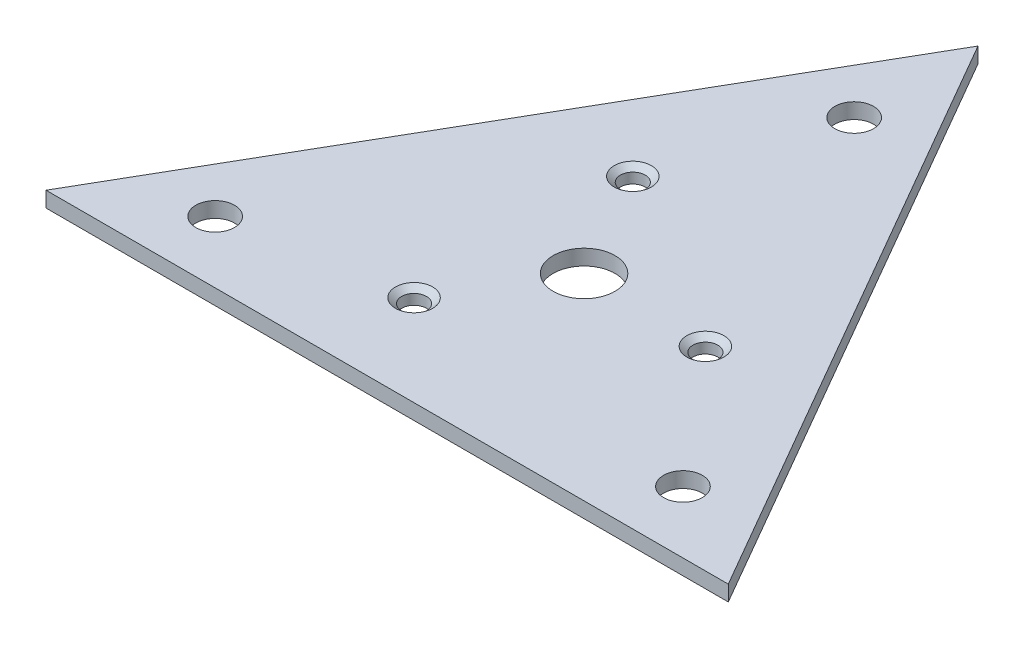
ISO-10303-21;
HEADER;
FILE_DESCRIPTION(('STEP AP214'),'2;1');
FILE_NAME('part.step','',(''),(''),'','','');
FILE_SCHEMA(('AUTOMOTIVE_DESIGN { 1 0 10303 214 1 1 1 1 }'));
ENDSEC;
DATA;
#1=APPLICATION_CONTEXT('core data for automotive mechanical design processes');
#2=APPLICATION_PROTOCOL_DEFINITION('international standard','automotive_design',2000,#1);
#3=PRODUCT_CONTEXT('',#1,'mechanical');
#4=PRODUCT('Part','Part','',(#3));
#5=PRODUCT_RELATED_PRODUCT_CATEGORY('part','',(#4));
#6=PRODUCT_DEFINITION_FORMATION('','',#4);
#7=PRODUCT_DEFINITION_CONTEXT('part definition',#1,'design');
#8=PRODUCT_DEFINITION('design','',#6,#7);
#9=PRODUCT_DEFINITION_SHAPE('','',#8);
#10=(LENGTH_UNIT() NAMED_UNIT(*) SI_UNIT(.MILLI.,.METRE.));
#11=(NAMED_UNIT(*) PLANE_ANGLE_UNIT() SI_UNIT($,.RADIAN.));
#12=(NAMED_UNIT(*) SI_UNIT($,.STERADIAN.) SOLID_ANGLE_UNIT());
#13=UNCERTAINTY_MEASURE_WITH_UNIT(LENGTH_MEASURE(1.E-05),#10,'distance_accuracy_value','');
#14=(GEOMETRIC_REPRESENTATION_CONTEXT(3) GLOBAL_UNCERTAINTY_ASSIGNED_CONTEXT((#13)) GLOBAL_UNIT_ASSIGNED_CONTEXT((#10,
#11,#12)) REPRESENTATION_CONTEXT('',''));
#15=CARTESIAN_POINT('',(0.,0.,0.));
#16=DIRECTION('',(0.,0.,1.));
#17=DIRECTION('',(1.,0.,0.));
#18=AXIS2_PLACEMENT_3D('',#15,#16,#17);
#19=CARTESIAN_POINT('',(0.,3.175,0.));
#20=DIRECTION('',(0.,1.,0.));
#21=DIRECTION('',(0.,0.,1.));
#22=AXIS2_PLACEMENT_3D('',#19,#20,#21);
#23=PLANE('',#22);
#24=CARTESIAN_POINT('',(56.8372969510367,3.175,-18.6639859636347));
#25=DIRECTION('',(0.,1.,0.));
#26=DIRECTION('',(0.,0.,1.));
#27=AXIS2_PLACEMENT_3D('',#24,#25,#26);
#28=CIRCLE('',#27,3.81);
#29=CARTESIAN_POINT('',(56.8372969510367,3.175,-14.8539859636347));
#30=VERTEX_POINT('',#29);
#31=EDGE_CURVE('E316',#30,#30,#28,.T.);
#32=ORIENTED_EDGE('',*,*,#31,.F.);
#33=EDGE_LOOP('',(#32));
#34=FACE_BOUND('',#33,.T.);
#35=CARTESIAN_POINT('',(95.3718655441002,3.175,-39.89055006022));
#36=DIRECTION('',(0.,1.,0.));
#37=DIRECTION('',(0.,0.,1.));
#38=AXIS2_PLACEMENT_3D('',#35,#36,#37);
#39=CIRCLE('',#38,3.80999999999999);
#40=CARTESIAN_POINT('',(95.3718655441002,3.175,-36.08055006022));
#41=VERTEX_POINT('',#40);
#42=EDGE_CURVE('E323',#41,#41,#39,.T.);
#43=ORIENTED_EDGE('',*,*,#42,.F.);
#44=EDGE_LOOP('',(#43));
#45=FACE_BOUND('',#44,.T.);
#46=CARTESIAN_POINT('',(57.721837504867,3.175,-62.6491833373943));
#47=DIRECTION('',(0.,1.,0.));
#48=DIRECTION('',(0.,0.,1.));
#49=AXIS2_PLACEMENT_3D('',#46,#47,#48);
#50=CIRCLE('',#49,3.81);
#51=CARTESIAN_POINT('',(57.721837504867,3.175,-58.8391833373943));
#52=VERTEX_POINT('',#51);
#53=EDGE_CURVE('E332',#52,#52,#50,.T.);
#54=ORIENTED_EDGE('',*,*,#53,.F.);
#55=EDGE_LOOP('',(#54));
#56=FACE_BOUND('',#55,.T.);
#57=CARTESIAN_POINT('',(21.9970452561248,3.175,-12.6999999999999));
#58=DIRECTION('',(0.,1.,0.));
#59=DIRECTION('',(0.,0.,1.));
#60=AXIS2_PLACEMENT_3D('',#57,#58,#59);
#61=CIRCLE('',#60,3.96875);
#62=CARTESIAN_POINT('',(21.9970452561248,3.175,-8.73124999999988));
#63=VERTEX_POINT('',#62);
#64=EDGE_CURVE('E132',#63,#63,#61,.T.);
#65=ORIENTED_EDGE('',*,*,#64,.F.);
#66=EDGE_LOOP('',(#65));
#67=FACE_BOUND('',#66,.T.);
#68=CARTESIAN_POINT('',(69.9770000000005,3.175,-40.4012397870822));
#69=DIRECTION('',(0.,1.,0.));
#70=DIRECTION('',(0.,0.,1.));
#71=AXIS2_PLACEMENT_3D('',#68,#69,#70);
#72=CIRCLE('',#71,6.35000000000001);
#73=CARTESIAN_POINT('',(69.9770000000005,3.175,-34.0512397870822));
#74=VERTEX_POINT('',#73);
#75=EDGE_CURVE('E92',#74,#74,#72,.T.);
#76=ORIENTED_EDGE('',*,*,#75,.F.);
#77=EDGE_LOOP('',(#76));
#78=FACE_BOUND('',#77,.T.);
#79=DIRECTION('',(-0.500000000000004,0.,0.866025403784436));
#80=VECTOR('',#79,1.);
#81=CARTESIAN_POINT('',(69.9770000000006,3.175,-121.203719361247));
#82=LINE('',#81,#80);
#83=CARTESIAN_POINT('',(69.9770000000006,3.175,-121.203719361247));
#84=VERTEX_POINT('',#83);
#85=CARTESIAN_POINT('',(0.,3.175,0.));
#86=VERTEX_POINT('',#85);
#87=EDGE_CURVE('E82',#84,#86,#82,.T.);
#88=ORIENTED_EDGE('',*,*,#87,.T.);
#89=DIRECTION('',(1.,0.,0.));
#90=VECTOR('',#89,1.);
#91=CARTESIAN_POINT('',(0.,3.175,0.));
#92=LINE('',#91,#90);
#93=CARTESIAN_POINT('',(139.954,3.175,0.));
#94=VERTEX_POINT('',#93);
#95=EDGE_CURVE('E78',#86,#94,#92,.T.);
#96=ORIENTED_EDGE('',*,*,#95,.T.);
#97=DIRECTION('',(-0.499999999999998,0.,-0.86602540378444));
#98=VECTOR('',#97,1.);
#99=CARTESIAN_POINT('',(69.9770000000006,3.175,-121.203719361247));
#100=LINE('',#99,#98);
#101=EDGE_CURVE('E58',#94,#84,#100,.T.);
#102=ORIENTED_EDGE('',*,*,#101,.T.);
#103=EDGE_LOOP('',(#88,#96,#102));
#104=FACE_BOUND('',#103,.T.);
#105=CARTESIAN_POINT('',(117.956954743875,3.175,-12.7));
#106=DIRECTION('',(0.,1.,0.));
#107=DIRECTION('',(0.,0.,1.));
#108=AXIS2_PLACEMENT_3D('',#105,#106,#107);
#109=CIRCLE('',#108,3.96874999999999);
#110=CARTESIAN_POINT('',(117.956954743875,3.175,-8.73125000000003));
#111=VERTEX_POINT('',#110);
#112=EDGE_CURVE('E136',#111,#111,#109,.T.);
#113=ORIENTED_EDGE('',*,*,#112,.F.);
#114=EDGE_LOOP('',(#113));
#115=FACE_BOUND('',#114,.T.);
#116=CARTESIAN_POINT('',(69.9770000000006,3.175,-95.803719361247));
#117=DIRECTION('',(0.,1.,0.));
#118=DIRECTION('',(0.,0.,1.));
#119=AXIS2_PLACEMENT_3D('',#116,#117,#118);
#120=CIRCLE('',#119,3.96874999999995);
#121=CARTESIAN_POINT('',(69.9770000000006,3.175,-91.8349693612471));
#122=VERTEX_POINT('',#121);
#123=EDGE_CURVE('E122',#122,#122,#120,.T.);
#124=ORIENTED_EDGE('',*,*,#123,.F.);
#125=EDGE_LOOP('',(#124));
#126=FACE_BOUND('',#125,.T.);
#127=ADVANCED_FACE('F41',(#34,#45,#56,#67,#78,#104,#115,#126),#23,.T.);
#128=CARTESIAN_POINT('',(0.,0.,0.));
#129=DIRECTION('',(0.,1.,0.));
#130=DIRECTION('',(0.,0.,1.));
#131=AXIS2_PLACEMENT_3D('',#128,#129,#130);
#132=PLANE('',#131);
#133=CARTESIAN_POINT('',(56.8372969510367,0.,-18.6639859636347));
#134=DIRECTION('',(0.,1.,0.));
#135=DIRECTION('',(0.,0.,1.));
#136=AXIS2_PLACEMENT_3D('',#133,#134,#135);
#137=CIRCLE('',#136,2.5527);
#138=CARTESIAN_POINT('',(56.8372969510367,0.,-16.1112859636347));
#139=VERTEX_POINT('',#138);
#140=EDGE_CURVE('E318',#139,#139,#137,.T.);
#141=ORIENTED_EDGE('',*,*,#140,.T.);
#142=EDGE_LOOP('',(#141));
#143=FACE_BOUND('',#142,.T.);
#144=CARTESIAN_POINT('',(95.3718655441002,0.,-39.89055006022));
#145=DIRECTION('',(0.,1.,0.));
#146=DIRECTION('',(0.,0.,1.));
#147=AXIS2_PLACEMENT_3D('',#144,#145,#146);
#148=CIRCLE('',#147,2.55269999999999);
#149=CARTESIAN_POINT('',(95.3718655441002,0.,-37.33785006022));
#150=VERTEX_POINT('',#149);
#151=EDGE_CURVE('E329',#150,#150,#148,.T.);
#152=ORIENTED_EDGE('',*,*,#151,.T.);
#153=EDGE_LOOP('',(#152));
#154=FACE_BOUND('',#153,.T.);
#155=CARTESIAN_POINT('',(57.721837504867,0.,-62.6491833373943));
#156=DIRECTION('',(0.,1.,0.));
#157=DIRECTION('',(0.,0.,1.));
#158=AXIS2_PLACEMENT_3D('',#155,#156,#157);
#159=CIRCLE('',#158,2.5527);
#160=CARTESIAN_POINT('',(57.721837504867,0.,-60.0964833373943));
#161=VERTEX_POINT('',#160);
#162=EDGE_CURVE('E338',#161,#161,#159,.T.);
#163=ORIENTED_EDGE('',*,*,#162,.T.);
#164=EDGE_LOOP('',(#163));
#165=FACE_BOUND('',#164,.T.);
#166=CARTESIAN_POINT('',(93.9669773719379,0.,-54.2518596806235));
#167=DIRECTION('',(0.,1.,0.));
#168=DIRECTION('',(0.,0.,1.));
#169=AXIS2_PLACEMENT_3D('',#166,#167,#168);
#170=CIRCLE('',#169,6.35);
#171=CARTESIAN_POINT('',(93.9669773719379,0.,-47.9018596806235));
#172=VERTEX_POINT('',#171);
#173=EDGE_CURVE('E128',#172,#172,#170,.T.);
#174=ORIENTED_EDGE('',*,*,#173,.T.);
#175=EDGE_LOOP('',(#174));
#176=FACE_BOUND('',#175,.T.);
#177=CARTESIAN_POINT('',(69.977,0.,-12.7));
#178=DIRECTION('',(0.,1.,0.));
#179=DIRECTION('',(0.,0.,1.));
#180=AXIS2_PLACEMENT_3D('',#177,#178,#179);
#181=CIRCLE('',#180,6.35);
#182=CARTESIAN_POINT('',(69.977,0.,-6.34999999999996));
#183=VERTEX_POINT('',#182);
#184=EDGE_CURVE('E347',#183,#183,#181,.T.);
#185=ORIENTED_EDGE('',*,*,#184,.T.);
#186=EDGE_LOOP('',(#185));
#187=FACE_BOUND('',#186,.T.);
#188=CARTESIAN_POINT('',(45.9870226280627,0.,-54.2518596806234));
#189=DIRECTION('',(0.,1.,0.));
#190=DIRECTION('',(0.,0.,1.));
#191=AXIS2_PLACEMENT_3D('',#188,#189,#190);
#192=CIRCLE('',#191,6.35);
#193=CARTESIAN_POINT('',(45.9870226280627,0.,-47.9018596806234));
#194=VERTEX_POINT('',#193);
#195=EDGE_CURVE('E340',#194,#194,#192,.T.);
#196=ORIENTED_EDGE('',*,*,#195,.T.);
#197=EDGE_LOOP('',(#196));
#198=FACE_BOUND('',#197,.T.);
#199=DIRECTION('',(-0.500000000000004,0.,0.866025403784436));
#200=VECTOR('',#199,1.);
#201=CARTESIAN_POINT('',(69.9770000000006,0.,-121.203719361247));
#202=LINE('',#201,#200);
#203=CARTESIAN_POINT('',(69.9770000000006,0.,-121.203719361247));
#204=VERTEX_POINT('',#203);
#205=CARTESIAN_POINT('',(0.,0.,0.));
#206=VERTEX_POINT('',#205);
#207=EDGE_CURVE('E89',#204,#206,#202,.T.);
#208=ORIENTED_EDGE('',*,*,#207,.F.);
#209=DIRECTION('',(-0.499999999999998,0.,-0.86602540378444));
#210=VECTOR('',#209,1.);
#211=CARTESIAN_POINT('',(69.9770000000006,0.,-121.203719361247));
#212=LINE('',#211,#210);
#213=CARTESIAN_POINT('',(139.954,0.,0.));
#214=VERTEX_POINT('',#213);
#215=EDGE_CURVE('E75',#214,#204,#212,.T.);
#216=ORIENTED_EDGE('',*,*,#215,.F.);
#217=DIRECTION('',(1.,0.,0.));
#218=VECTOR('',#217,1.);
#219=CARTESIAN_POINT('',(0.,0.,0.));
#220=LINE('',#219,#218);
#221=EDGE_CURVE('E70',#206,#214,#220,.T.);
#222=ORIENTED_EDGE('',*,*,#221,.F.);
#223=EDGE_LOOP('',(#208,#216,#222));
#224=FACE_BOUND('',#223,.T.);
#225=CARTESIAN_POINT('',(69.9770000000005,0.,-40.4012397870822));
#226=DIRECTION('',(0.,1.,0.));
#227=DIRECTION('',(0.,0.,1.));
#228=AXIS2_PLACEMENT_3D('',#225,#226,#227);
#229=CIRCLE('',#228,6.35000000000001);
#230=CARTESIAN_POINT('',(69.9770000000005,0.,-34.0512397870822));
#231=VERTEX_POINT('',#230);
#232=EDGE_CURVE('E96',#231,#231,#229,.T.);
#233=ORIENTED_EDGE('',*,*,#232,.T.);
#234=EDGE_LOOP('',(#233));
#235=FACE_BOUND('',#234,.T.);
#236=CARTESIAN_POINT('',(117.956954743875,0.,-12.7));
#237=DIRECTION('',(0.,1.,0.));
#238=DIRECTION('',(0.,0.,1.));
#239=AXIS2_PLACEMENT_3D('',#236,#237,#238);
#240=CIRCLE('',#239,3.96874999999999);
#241=CARTESIAN_POINT('',(117.956954743875,0.,-8.73125000000003));
#242=VERTEX_POINT('',#241);
#243=EDGE_CURVE('E113',#242,#242,#240,.T.);
#244=ORIENTED_EDGE('',*,*,#243,.T.);
#245=EDGE_LOOP('',(#244));
#246=FACE_BOUND('',#245,.T.);
#247=CARTESIAN_POINT('',(21.9970452561248,0.,-12.6999999999999));
#248=DIRECTION('',(0.,1.,0.));
#249=DIRECTION('',(0.,0.,1.));
#250=AXIS2_PLACEMENT_3D('',#247,#248,#249);
#251=CIRCLE('',#250,3.96875);
#252=CARTESIAN_POINT('',(21.9970452561248,0.,-8.73124999999988));
#253=VERTEX_POINT('',#252);
#254=EDGE_CURVE('E117',#253,#253,#251,.T.);
#255=ORIENTED_EDGE('',*,*,#254,.T.);
#256=EDGE_LOOP('',(#255));
#257=FACE_BOUND('',#256,.T.);
#258=CARTESIAN_POINT('',(69.9770000000006,0.,-95.803719361247));
#259=DIRECTION('',(0.,1.,0.));
#260=DIRECTION('',(0.,0.,1.));
#261=AXIS2_PLACEMENT_3D('',#258,#259,#260);
#262=CIRCLE('',#261,3.96874999999995);
#263=CARTESIAN_POINT('',(69.9770000000006,0.,-91.8349693612471));
#264=VERTEX_POINT('',#263);
#265=EDGE_CURVE('E120',#264,#264,#262,.T.);
#266=ORIENTED_EDGE('',*,*,#265,.T.);
#267=EDGE_LOOP('',(#266));
#268=FACE_BOUND('',#267,.T.);
#269=ADVANCED_FACE('F102',(#143,#154,#165,#176,#187,#198,#224,#235,#246,#257,#268),#132,.F.);
#270=CARTESIAN_POINT('',(69.9770000000006,3.175,-121.203719361247));
#271=DIRECTION('',(0.866025403784436,0.,0.500000000000004));
#272=DIRECTION('',(0.500000000000004,0.,-0.866025403784436));
#273=AXIS2_PLACEMENT_3D('',#270,#271,#272);
#274=PLANE('',#273);
#275=ORIENTED_EDGE('',*,*,#207,.T.);
#276=DIRECTION('',(0.,-1.,0.));
#277=VECTOR('',#276,1.);
#278=CARTESIAN_POINT('',(0.,3.175,0.));
#279=LINE('',#278,#277);
#280=EDGE_CURVE('E11',#86,#206,#279,.T.);
#281=ORIENTED_EDGE('',*,*,#280,.F.);
#282=ORIENTED_EDGE('',*,*,#87,.F.);
#283=DIRECTION('',(0.,-1.,0.));
#284=VECTOR('',#283,1.);
#285=CARTESIAN_POINT('',(69.9770000000006,3.175,-121.203719361247));
#286=LINE('',#285,#284);
#287=EDGE_CURVE('E90',#84,#204,#286,.T.);
#288=ORIENTED_EDGE('',*,*,#287,.T.);
#289=EDGE_LOOP('',(#275,#281,#282,#288));
#290=FACE_BOUND('',#289,.T.);
#291=ADVANCED_FACE('F43',(#290),#274,.F.);
#292=CARTESIAN_POINT('',(0.,3.175,0.));
#293=DIRECTION('',(0.,0.,-1.));
#294=DIRECTION('',(-1.,0.,0.));
#295=AXIS2_PLACEMENT_3D('',#292,#293,#294);
#296=PLANE('',#295);
#297=ORIENTED_EDGE('',*,*,#221,.T.);
#298=DIRECTION('',(0.,-1.,0.));
#299=VECTOR('',#298,1.);
#300=CARTESIAN_POINT('',(139.954,3.175,0.));
#301=LINE('',#300,#299);
#302=EDGE_CURVE('E50',#94,#214,#301,.T.);
#303=ORIENTED_EDGE('',*,*,#302,.F.);
#304=ORIENTED_EDGE('',*,*,#95,.F.);
#305=ORIENTED_EDGE('',*,*,#280,.T.);
#306=EDGE_LOOP('',(#297,#303,#304,#305));
#307=FACE_BOUND('',#306,.T.);
#308=ADVANCED_FACE('F79',(#307),#296,.F.);
#309=CARTESIAN_POINT('',(69.9770000000006,3.175,-121.203719361247));
#310=DIRECTION('',(-0.86602540378444,0.,0.499999999999998));
#311=DIRECTION('',(0.499999999999998,0.,0.86602540378444));
#312=AXIS2_PLACEMENT_3D('',#309,#310,#311);
#313=PLANE('',#312);
#314=ORIENTED_EDGE('',*,*,#215,.T.);
#315=ORIENTED_EDGE('',*,*,#287,.F.);
#316=ORIENTED_EDGE('',*,*,#101,.F.);
#317=ORIENTED_EDGE('',*,*,#302,.T.);
#318=EDGE_LOOP('',(#314,#315,#316,#317));
#319=FACE_BOUND('',#318,.T.);
#320=ADVANCED_FACE('F101',(#319),#313,.F.);
#321=CARTESIAN_POINT('',(69.9770000000005,3.175,-40.4012397870822));
#322=DIRECTION('',(0.,-1.,0.));
#323=DIRECTION('',(0.,0.,-1.));
#324=AXIS2_PLACEMENT_3D('',#321,#322,#323);
#325=CYLINDRICAL_SURFACE('',#324,6.35000000000001);
#326=ORIENTED_EDGE('',*,*,#75,.T.);
#327=EDGE_LOOP('',(#326));
#328=FACE_BOUND('',#327,.T.);
#329=ORIENTED_EDGE('',*,*,#232,.F.);
#330=EDGE_LOOP('',(#329));
#331=FACE_BOUND('',#330,.T.);
#332=ADVANCED_FACE('F168',(#328,#331),#325,.F.);
#333=CARTESIAN_POINT('',(117.956954743875,3.175,-12.7));
#334=DIRECTION('',(0.,-1.,0.));
#335=DIRECTION('',(0.,0.,-1.));
#336=AXIS2_PLACEMENT_3D('',#333,#334,#335);
#337=CYLINDRICAL_SURFACE('',#336,3.96874999999999);
#338=ORIENTED_EDGE('',*,*,#112,.T.);
#339=EDGE_LOOP('',(#338));
#340=FACE_BOUND('',#339,.T.);
#341=ORIENTED_EDGE('',*,*,#243,.F.);
#342=EDGE_LOOP('',(#341));
#343=FACE_BOUND('',#342,.T.);
#344=ADVANCED_FACE('F142',(#340,#343),#337,.F.);
#345=CARTESIAN_POINT('',(21.9970452561248,3.175,-12.6999999999999));
#346=DIRECTION('',(0.,-1.,0.));
#347=DIRECTION('',(0.,0.,-1.));
#348=AXIS2_PLACEMENT_3D('',#345,#346,#347);
#349=CYLINDRICAL_SURFACE('',#348,3.96875);
#350=ORIENTED_EDGE('',*,*,#64,.T.);
#351=EDGE_LOOP('',(#350));
#352=FACE_BOUND('',#351,.T.);
#353=ORIENTED_EDGE('',*,*,#254,.F.);
#354=EDGE_LOOP('',(#353));
#355=FACE_BOUND('',#354,.T.);
#356=ADVANCED_FACE('F153',(#352,#355),#349,.F.);
#357=CARTESIAN_POINT('',(69.9770000000006,3.175,-95.803719361247));
#358=DIRECTION('',(0.,-1.,0.));
#359=DIRECTION('',(0.,0.,-1.));
#360=AXIS2_PLACEMENT_3D('',#357,#358,#359);
#361=CYLINDRICAL_SURFACE('',#360,3.96874999999995);
#362=ORIENTED_EDGE('',*,*,#123,.T.);
#363=EDGE_LOOP('',(#362));
#364=FACE_BOUND('',#363,.T.);
#365=ORIENTED_EDGE('',*,*,#265,.F.);
#366=EDGE_LOOP('',(#365));
#367=FACE_BOUND('',#366,.T.);
#368=ADVANCED_FACE('F150',(#364,#367),#361,.F.);
#369=CARTESIAN_POINT('',(45.9870226280627,0.254,-54.2518596806234));
#370=DIRECTION('',(0.,-1.,0.));
#371=DIRECTION('',(0.,0.,-1.));
#372=AXIS2_PLACEMENT_3D('',#369,#370,#371);
#373=CYLINDRICAL_SURFACE('',#372,6.35);
#374=CARTESIAN_POINT('',(45.9870226280627,0.254,-54.2518596806234));
#375=DIRECTION('',(0.,1.,0.));
#376=DIRECTION('',(0.,0.,1.));
#377=AXIS2_PLACEMENT_3D('',#374,#375,#376);
#378=CIRCLE('',#377,6.35);
#379=CARTESIAN_POINT('',(45.9870226280627,0.254,-47.9018596806234));
#380=VERTEX_POINT('',#379);
#381=EDGE_CURVE('E350',#380,#380,#378,.T.);
#382=ORIENTED_EDGE('',*,*,#381,.T.);
#383=EDGE_LOOP('',(#382));
#384=FACE_BOUND('',#383,.T.);
#385=ORIENTED_EDGE('',*,*,#195,.F.);
#386=EDGE_LOOP('',(#385));
#387=FACE_BOUND('',#386,.T.);
#388=ADVANCED_FACE('F152',(#384,#387),#373,.F.);
#389=CARTESIAN_POINT('',(45.9870226280627,0.254,-54.2518596806234));
#390=DIRECTION('',(0.,1.,0.));
#391=DIRECTION('',(0.,0.,1.));
#392=AXIS2_PLACEMENT_3D('',#389,#390,#391);
#393=PLANE('',#392);
#394=ORIENTED_EDGE('',*,*,#381,.F.);
#395=EDGE_LOOP('',(#394));
#396=FACE_BOUND('',#395,.T.);
#397=ADVANCED_FACE('F159',(#396),#393,.F.);
#398=CARTESIAN_POINT('',(69.977,0.254,-12.7));
#399=DIRECTION('',(0.,-1.,0.));
#400=DIRECTION('',(0.,0.,-1.));
#401=AXIS2_PLACEMENT_3D('',#398,#399,#400);
#402=CYLINDRICAL_SURFACE('',#401,6.35);
#403=CARTESIAN_POINT('',(69.977,0.254,-12.7));
#404=DIRECTION('',(0.,1.,0.));
#405=DIRECTION('',(0.,0.,1.));
#406=AXIS2_PLACEMENT_3D('',#403,#404,#405);
#407=CIRCLE('',#406,6.35);
#408=CARTESIAN_POINT('',(69.977,0.254,-6.34999999999996));
#409=VERTEX_POINT('',#408);
#410=EDGE_CURVE('E344',#409,#409,#407,.T.);
#411=ORIENTED_EDGE('',*,*,#410,.T.);
#412=EDGE_LOOP('',(#411));
#413=FACE_BOUND('',#412,.T.);
#414=ORIENTED_EDGE('',*,*,#184,.F.);
#415=EDGE_LOOP('',(#414));
#416=FACE_BOUND('',#415,.T.);
#417=ADVANCED_FACE('F223',(#413,#416),#402,.F.);
#418=CARTESIAN_POINT('',(69.977,0.254,-12.7));
#419=DIRECTION('',(0.,1.,0.));
#420=DIRECTION('',(0.,0.,1.));
#421=AXIS2_PLACEMENT_3D('',#418,#419,#420);
#422=PLANE('',#421);
#423=ORIENTED_EDGE('',*,*,#410,.F.);
#424=EDGE_LOOP('',(#423));
#425=FACE_BOUND('',#424,.T.);
#426=ADVANCED_FACE('F213',(#425),#422,.F.);
#427=CARTESIAN_POINT('',(93.9669773719379,0.254,-54.2518596806235));
#428=DIRECTION('',(0.,-1.,0.));
#429=DIRECTION('',(0.,0.,-1.));
#430=AXIS2_PLACEMENT_3D('',#427,#428,#429);
#431=CYLINDRICAL_SURFACE('',#430,6.35);
#432=CARTESIAN_POINT('',(93.9669773719379,0.254,-54.2518596806235));
#433=DIRECTION('',(0.,1.,0.));
#434=DIRECTION('',(0.,0.,1.));
#435=AXIS2_PLACEMENT_3D('',#432,#433,#434);
#436=CIRCLE('',#435,6.35);
#437=CARTESIAN_POINT('',(93.9669773719379,0.254,-47.9018596806235));
#438=VERTEX_POINT('',#437);
#439=EDGE_CURVE('E123',#438,#438,#436,.T.);
#440=ORIENTED_EDGE('',*,*,#439,.T.);
#441=EDGE_LOOP('',(#440));
#442=FACE_BOUND('',#441,.T.);
#443=ORIENTED_EDGE('',*,*,#173,.F.);
#444=EDGE_LOOP('',(#443));
#445=FACE_BOUND('',#444,.T.);
#446=ADVANCED_FACE('F201',(#442,#445),#431,.F.);
#447=CARTESIAN_POINT('',(93.9669773719379,0.254,-54.2518596806235));
#448=DIRECTION('',(0.,1.,0.));
#449=DIRECTION('',(0.,0.,1.));
#450=AXIS2_PLACEMENT_3D('',#447,#448,#449);
#451=PLANE('',#450);
#452=ORIENTED_EDGE('',*,*,#439,.F.);
#453=EDGE_LOOP('',(#452));
#454=FACE_BOUND('',#453,.T.);
#455=ADVANCED_FACE('F195',(#454),#451,.F.);
#456=CARTESIAN_POINT('',(57.721837504867,3.175,-62.6491833373943));
#457=DIRECTION('',(0.,1.,0.));
#458=DIRECTION('',(0.,0.,1.));
#459=AXIS2_PLACEMENT_3D('',#456,#457,#458);
#460=CYLINDRICAL_SURFACE('',#459,2.55269999999999);
#461=ORIENTED_EDGE('',*,*,#162,.F.);
#462=EDGE_LOOP('',(#461));
#463=FACE_BOUND('',#462,.T.);
#464=CARTESIAN_POINT('',(57.721837504867,2.1200000337208,-62.6491833373943));
#465=DIRECTION('',(0.,1.,0.));
#466=DIRECTION('',(0.,0.,1.));
#467=AXIS2_PLACEMENT_3D('',#464,#465,#466);
#468=CIRCLE('',#467,2.55269999999999);
#469=CARTESIAN_POINT('',(57.721837504867,2.1200000337208,-60.0964833373943));
#470=VERTEX_POINT('',#469);
#471=EDGE_CURVE('E335',#470,#470,#468,.T.);
#472=ORIENTED_EDGE('',*,*,#471,.T.);
#473=EDGE_LOOP('',(#472));
#474=FACE_BOUND('',#473,.T.);
#475=ADVANCED_FACE('F200',(#463,#474),#460,.F.);
#476=CARTESIAN_POINT('',(57.721837504867,3.175,-62.6491833373943));
#477=DIRECTION('',(0.,1.,0.));
#478=DIRECTION('',(0.,0.,1.));
#479=AXIS2_PLACEMENT_3D('',#476,#477,#478);
#480=CONICAL_SURFACE('',#479,3.81,0.872664625997167);
#481=ORIENTED_EDGE('',*,*,#471,.F.);
#482=EDGE_LOOP('',(#481));
#483=FACE_BOUND('',#482,.T.);
#484=ORIENTED_EDGE('',*,*,#53,.T.);
#485=EDGE_LOOP('',(#484));
#486=FACE_BOUND('',#485,.T.);
#487=ADVANCED_FACE('F288',(#483,#486),#480,.F.);
#488=CARTESIAN_POINT('',(95.3718655441002,3.175,-39.89055006022));
#489=DIRECTION('',(0.,1.,0.));
#490=DIRECTION('',(0.,0.,1.));
#491=AXIS2_PLACEMENT_3D('',#488,#489,#490);
#492=CYLINDRICAL_SURFACE('',#491,2.55269999999999);
#493=ORIENTED_EDGE('',*,*,#151,.F.);
#494=EDGE_LOOP('',(#493));
#495=FACE_BOUND('',#494,.T.);
#496=CARTESIAN_POINT('',(95.3718655441002,2.1200000337208,-39.89055006022));
#497=DIRECTION('',(0.,1.,0.));
#498=DIRECTION('',(0.,0.,1.));
#499=AXIS2_PLACEMENT_3D('',#496,#497,#498);
#500=CIRCLE('',#499,2.55269999999999);
#501=CARTESIAN_POINT('',(95.3718655441002,2.1200000337208,-37.33785006022));
#502=VERTEX_POINT('',#501);
#503=EDGE_CURVE('E326',#502,#502,#500,.T.);
#504=ORIENTED_EDGE('',*,*,#503,.T.);
#505=EDGE_LOOP('',(#504));
#506=FACE_BOUND('',#505,.T.);
#507=ADVANCED_FACE('F292',(#495,#506),#492,.F.);
#508=CARTESIAN_POINT('',(95.3718655441002,3.175,-39.89055006022));
#509=DIRECTION('',(0.,1.,0.));
#510=DIRECTION('',(0.,0.,1.));
#511=AXIS2_PLACEMENT_3D('',#508,#509,#510);
#512=CONICAL_SURFACE('',#511,3.80999999999999,0.872664625997164);
#513=ORIENTED_EDGE('',*,*,#503,.F.);
#514=EDGE_LOOP('',(#513));
#515=FACE_BOUND('',#514,.T.);
#516=ORIENTED_EDGE('',*,*,#42,.T.);
#517=EDGE_LOOP('',(#516));
#518=FACE_BOUND('',#517,.T.);
#519=ADVANCED_FACE('F296',(#515,#518),#512,.F.);
#520=CARTESIAN_POINT('',(56.8372969510367,3.175,-18.6639859636347));
#521=DIRECTION('',(0.,1.,0.));
#522=DIRECTION('',(0.,0.,1.));
#523=AXIS2_PLACEMENT_3D('',#520,#521,#522);
#524=CYLINDRICAL_SURFACE('',#523,2.55269999999999);
#525=ORIENTED_EDGE('',*,*,#140,.F.);
#526=EDGE_LOOP('',(#525));
#527=FACE_BOUND('',#526,.T.);
#528=CARTESIAN_POINT('',(56.8372969510367,2.1200000337208,-18.6639859636347));
#529=DIRECTION('',(0.,1.,0.));
#530=DIRECTION('',(0.,0.,1.));
#531=AXIS2_PLACEMENT_3D('',#528,#529,#530);
#532=CIRCLE('',#531,2.55269999999999);
#533=CARTESIAN_POINT('',(56.8372969510367,2.1200000337208,-16.1112859636347));
#534=VERTEX_POINT('',#533);
#535=EDGE_CURVE('E313',#534,#534,#532,.T.);
#536=ORIENTED_EDGE('',*,*,#535,.T.);
#537=EDGE_LOOP('',(#536));
#538=FACE_BOUND('',#537,.T.);
#539=ADVANCED_FACE('F300',(#527,#538),#524,.F.);
#540=CARTESIAN_POINT('',(56.8372969510367,3.175,-18.6639859636347));
#541=DIRECTION('',(0.,1.,0.));
#542=DIRECTION('',(0.,0.,1.));
#543=AXIS2_PLACEMENT_3D('',#540,#541,#542);
#544=CONICAL_SURFACE('',#543,3.81,0.872664625997167);
#545=ORIENTED_EDGE('',*,*,#535,.F.);
#546=EDGE_LOOP('',(#545));
#547=FACE_BOUND('',#546,.T.);
#548=ORIENTED_EDGE('',*,*,#31,.T.);
#549=EDGE_LOOP('',(#548));
#550=FACE_BOUND('',#549,.T.);
#551=ADVANCED_FACE('F304',(#547,#550),#544,.F.);
#552=CLOSED_SHELL('',(#127,#269,#291,#308,#320,#332,#344,#356,#368,#388,#397,#417,#426,#446,
#455,#475,#487,#507,#519,#539,#551));
#553=MANIFOLD_SOLID_BREP('B2',#552);
#554=ADVANCED_BREP_SHAPE_REPRESENTATION('',(#18,#553),#14);
#555=SHAPE_DEFINITION_REPRESENTATION(#9,#554);
ENDSEC;
END-ISO-10303-21;
